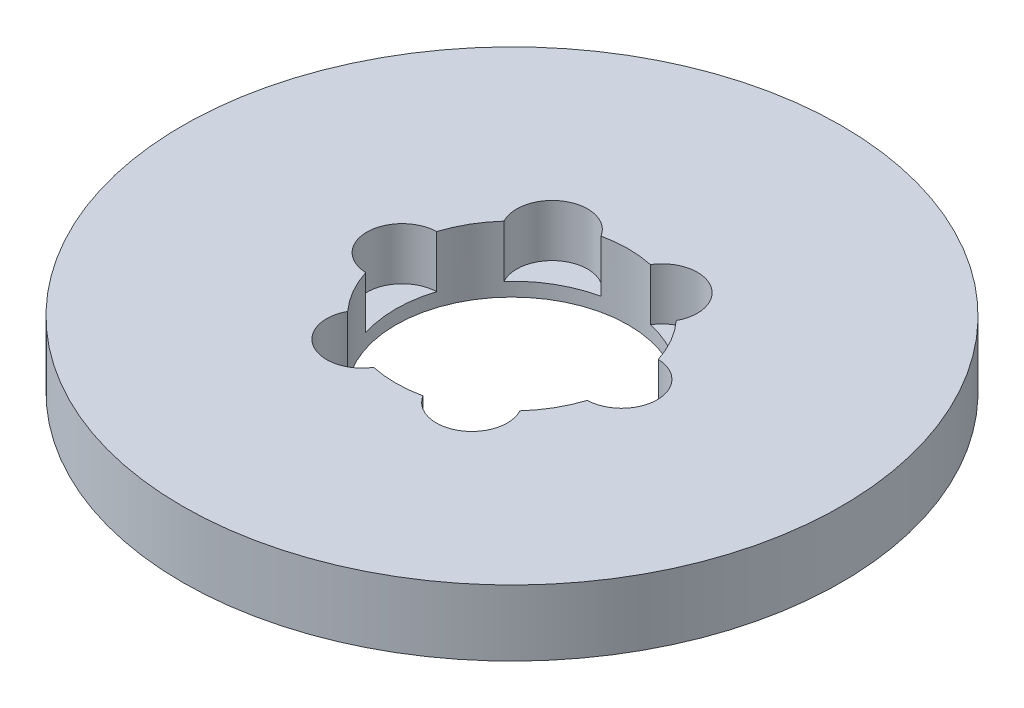
ISO-10303-21;
HEADER;
FILE_DESCRIPTION(('STEP AP214'),'2;1');
FILE_NAME('part.step','',(''),(''),'','','');
FILE_SCHEMA(('AUTOMOTIVE_DESIGN { 1 0 10303 214 1 1 1 1 }'));
ENDSEC;
DATA;
#1=APPLICATION_CONTEXT('core data for automotive mechanical design processes');
#2=APPLICATION_PROTOCOL_DEFINITION('international standard','automotive_design',2000,#1);
#3=PRODUCT_CONTEXT('',#1,'mechanical');
#4=PRODUCT('Part','Part','',(#3));
#5=PRODUCT_RELATED_PRODUCT_CATEGORY('part','',(#4));
#6=PRODUCT_DEFINITION_FORMATION('','',#4);
#7=PRODUCT_DEFINITION_CONTEXT('part definition',#1,'design');
#8=PRODUCT_DEFINITION('design','',#6,#7);
#9=PRODUCT_DEFINITION_SHAPE('','',#8);
#10=(LENGTH_UNIT() NAMED_UNIT(*) SI_UNIT(.MILLI.,.METRE.));
#11=(NAMED_UNIT(*) PLANE_ANGLE_UNIT() SI_UNIT($,.RADIAN.));
#12=(NAMED_UNIT(*) SI_UNIT($,.STERADIAN.) SOLID_ANGLE_UNIT());
#13=UNCERTAINTY_MEASURE_WITH_UNIT(LENGTH_MEASURE(1.E-05),#10,'distance_accuracy_value','');
#14=(GEOMETRIC_REPRESENTATION_CONTEXT(3) GLOBAL_UNCERTAINTY_ASSIGNED_CONTEXT((#13)) GLOBAL_UNIT_ASSIGNED_CONTEXT((#10,
#11,#12)) REPRESENTATION_CONTEXT('',''));
#15=CARTESIAN_POINT('',(0.,0.,0.));
#16=DIRECTION('',(0.,0.,1.));
#17=DIRECTION('',(1.,0.,0.));
#18=AXIS2_PLACEMENT_3D('',#15,#16,#17);
#19=CARTESIAN_POINT('',(0.,17.,0.));
#20=DIRECTION('',(0.,-1.,0.));
#21=DIRECTION('',(0.,0.,-1.));
#22=AXIS2_PLACEMENT_3D('',#19,#20,#21);
#23=CYLINDRICAL_SURFACE('',#22,85.);
#24=CARTESIAN_POINT('',(0.,17.,0.));
#25=DIRECTION('',(0.,1.,0.));
#26=DIRECTION('',(0.,0.,1.));
#27=AXIS2_PLACEMENT_3D('',#24,#25,#26);
#28=CIRCLE('',#27,85.);
#29=CARTESIAN_POINT('',(0.,17.,85.));
#30=VERTEX_POINT('',#29);
#31=EDGE_CURVE('E162',#30,#30,#28,.T.);
#32=ORIENTED_EDGE('',*,*,#31,.F.);
#33=EDGE_LOOP('',(#32));
#34=FACE_BOUND('',#33,.T.);
#35=CARTESIAN_POINT('',(0.,0.,0.));
#36=DIRECTION('',(0.,1.,0.));
#37=DIRECTION('',(0.,0.,1.));
#38=AXIS2_PLACEMENT_3D('',#35,#36,#37);
#39=CIRCLE('',#38,85.);
#40=CARTESIAN_POINT('',(0.,0.,85.));
#41=VERTEX_POINT('',#40);
#42=EDGE_CURVE('E157',#41,#41,#39,.T.);
#43=ORIENTED_EDGE('',*,*,#42,.T.);
#44=EDGE_LOOP('',(#43));
#45=FACE_BOUND('',#44,.T.);
#46=ADVANCED_FACE('F39',(#34,#45),#23,.T.);
#47=CARTESIAN_POINT('',(0.,17.,0.));
#48=DIRECTION('',(0.,1.,0.));
#49=DIRECTION('',(0.,0.,1.));
#50=AXIS2_PLACEMENT_3D('',#47,#48,#49);
#51=PLANE('',#50);
#52=CARTESIAN_POINT('',(-14.1526797020689,17.,-24.5131603072314));
#53=DIRECTION('',(0.,1.,0.));
#54=DIRECTION('',(-0.866025403784433,0.,0.50000000000001));
#55=AXIS2_PLACEMENT_3D('',#52,#53,#54);
#56=CIRCLE('',#55,9.15738785733083);
#57=CARTESIAN_POINT('',(-6.3574793077483,17.,-29.3186366813253));
#58=VERTEX_POINT('',#57);
#59=CARTESIAN_POINT('',(-22.2119445164803,17.,-20.1650569252061));
#60=VERTEX_POINT('',#59);
#61=EDGE_CURVE('E218',#58,#60,#56,.T.);
#62=ORIENTED_EDGE('',*,*,#61,.F.);
#63=CARTESIAN_POINT('',(0.,17.,0.));
#64=DIRECTION('',(0.,1.,0.));
#65=DIRECTION('',(0.,0.,1.));
#66=AXIS2_PLACEMENT_3D('',#63,#64,#65);
#67=CIRCLE('',#66,30.);
#68=CARTESIAN_POINT('',(6.35747930774768,17.,-29.3186366813254));
#69=VERTEX_POINT('',#68);
#70=EDGE_CURVE('E169',#69,#58,#67,.T.);
#71=ORIENTED_EDGE('',*,*,#70,.F.);
#72=CARTESIAN_POINT('',(14.1526797020684,17.,-24.5131603072317));
#73=DIRECTION('',(0.,1.,0.));
#74=DIRECTION('',(-0.866025403784443,0.,-0.499999999999992));
#75=AXIS2_PLACEMENT_3D('',#72,#73,#74);
#76=CIRCLE('',#75,9.15738785733083);
#77=CARTESIAN_POINT('',(22.2119445164799,17.,-20.1650569252065));
#78=VERTEX_POINT('',#77);
#79=EDGE_CURVE('E285',#78,#69,#76,.T.);
#80=ORIENTED_EDGE('',*,*,#79,.F.);
#81=CARTESIAN_POINT('',(28.569423824228,17.,-9.15357975611904));
#82=VERTEX_POINT('',#81);
#83=EDGE_CURVE('E174',#82,#78,#67,.T.);
#84=ORIENTED_EDGE('',*,*,#83,.F.);
#85=CARTESIAN_POINT('',(28.3053594041372,17.,0.));
#86=DIRECTION('',(0.,1.,0.));
#87=DIRECTION('',(0.,0.,-1.));
#88=AXIS2_PLACEMENT_3D('',#85,#86,#87);
#89=CIRCLE('',#88,9.15738785733083);
#90=CARTESIAN_POINT('',(28.569423824228,17.,9.15357975611904));
#91=VERTEX_POINT('',#90);
#92=EDGE_CURVE('E280',#91,#82,#89,.T.);
#93=ORIENTED_EDGE('',*,*,#92,.F.);
#94=CARTESIAN_POINT('',(22.2119445164802,17.,20.1650569252062));
#95=VERTEX_POINT('',#94);
#96=EDGE_CURVE('E164',#95,#91,#67,.T.);
#97=ORIENTED_EDGE('',*,*,#96,.F.);
#98=CARTESIAN_POINT('',(14.1526797020687,17.,24.5131603072315));
#99=DIRECTION('',(0.,1.,0.));
#100=DIRECTION('',(0.866025403784436,0.,-0.500000000000004));
#101=AXIS2_PLACEMENT_3D('',#98,#99,#100);
#102=CIRCLE('',#101,9.15738785733083);
#103=CARTESIAN_POINT('',(6.35747930774809,17.,29.3186366813253));
#104=VERTEX_POINT('',#103);
#105=EDGE_CURVE('E269',#104,#95,#102,.T.);
#106=ORIENTED_EDGE('',*,*,#105,.F.);
#107=CARTESIAN_POINT('',(-6.35747930774789,17.,29.3186366813254));
#108=VERTEX_POINT('',#107);
#109=EDGE_CURVE('E149',#108,#104,#67,.T.);
#110=ORIENTED_EDGE('',*,*,#109,.F.);
#111=CARTESIAN_POINT('',(-14.1526797020686,17.,24.5131603072316));
#112=DIRECTION('',(0.,1.,0.));
#113=DIRECTION('',(0.86602540378444,0.,0.499999999999998));
#114=AXIS2_PLACEMENT_3D('',#111,#112,#113);
#115=CIRCLE('',#114,9.15738785733083);
#116=CARTESIAN_POINT('',(-22.21194451648,17.,20.1650569252064));
#117=VERTEX_POINT('',#116);
#118=EDGE_CURVE('E128',#117,#108,#115,.T.);
#119=ORIENTED_EDGE('',*,*,#118,.F.);
#120=CARTESIAN_POINT('',(-28.569423824228,17.,9.15357975611904));
#121=VERTEX_POINT('',#120);
#122=EDGE_CURVE('E148',#121,#117,#67,.T.);
#123=ORIENTED_EDGE('',*,*,#122,.F.);
#124=CARTESIAN_POINT('',(-28.3053594041372,17.,0.));
#125=DIRECTION('',(0.,1.,0.));
#126=DIRECTION('',(0.,0.,1.));
#127=AXIS2_PLACEMENT_3D('',#124,#125,#126);
#128=CIRCLE('',#127,9.15738785733083);
#129=CARTESIAN_POINT('',(-28.569423824228,17.,-9.15357975611904));
#130=VERTEX_POINT('',#129);
#131=EDGE_CURVE('E179',#130,#121,#128,.T.);
#132=ORIENTED_EDGE('',*,*,#131,.F.);
#133=EDGE_CURVE('E161',#60,#130,#67,.T.);
#134=ORIENTED_EDGE('',*,*,#133,.F.);
#135=EDGE_LOOP('',(#62,#71,#80,#84,#93,#97,#106,#110,#119,#123,#132,#134));
#136=FACE_BOUND('',#135,.T.);
#137=ORIENTED_EDGE('',*,*,#31,.T.);
#138=EDGE_LOOP('',(#137));
#139=FACE_BOUND('',#138,.T.);
#140=ADVANCED_FACE('F141',(#136,#139),#51,.T.);
#141=CARTESIAN_POINT('',(0.,0.,0.));
#142=DIRECTION('',(0.,1.,0.));
#143=DIRECTION('',(0.,0.,1.));
#144=AXIS2_PLACEMENT_3D('',#141,#142,#143);
#145=PLANE('',#144);
#146=CARTESIAN_POINT('',(0.,0.,0.));
#147=DIRECTION('',(0.,1.,0.));
#148=DIRECTION('',(0.,0.,1.));
#149=AXIS2_PLACEMENT_3D('',#146,#147,#148);
#150=CIRCLE('',#149,30.);
#151=CARTESIAN_POINT('',(0.,0.,30.));
#152=VERTEX_POINT('',#151);
#153=EDGE_CURVE('E166',#152,#152,#150,.T.);
#154=ORIENTED_EDGE('',*,*,#153,.T.);
#155=EDGE_LOOP('',(#154));
#156=FACE_BOUND('',#155,.T.);
#157=ORIENTED_EDGE('',*,*,#42,.F.);
#158=EDGE_LOOP('',(#157));
#159=FACE_BOUND('',#158,.T.);
#160=ADVANCED_FACE('F234',(#156,#159),#145,.F.);
#161=CARTESIAN_POINT('',(0.,17.,0.));
#162=DIRECTION('',(0.,-1.,0.));
#163=DIRECTION('',(0.,0.,-1.));
#164=AXIS2_PLACEMENT_3D('',#161,#162,#163);
#165=CYLINDRICAL_SURFACE('',#164,30.);
#166=DIRECTION('',(0.,1.,0.));
#167=VECTOR('',#166,1.);
#168=CARTESIAN_POINT('',(-6.3574793077483,10.2793345800739,-29.3186366813253));
#169=LINE('',#168,#167);
#170=CARTESIAN_POINT('',(-6.3574793077483,3.55866916014774,-29.3186366813253));
#171=VERTEX_POINT('',#170);
#172=EDGE_CURVE('E11',#171,#58,#169,.T.);
#173=ORIENTED_EDGE('',*,*,#172,.F.);
#174=CARTESIAN_POINT('',(0.,3.55866916014774,0.));
#175=DIRECTION('',(0.,1.,0.));
#176=DIRECTION('',(0.,0.,1.));
#177=AXIS2_PLACEMENT_3D('',#174,#175,#176);
#178=CIRCLE('',#177,30.);
#179=CARTESIAN_POINT('',(-22.2119445164803,3.55866916014774,-20.1650569252061));
#180=VERTEX_POINT('',#179);
#181=EDGE_CURVE('E214',#171,#180,#178,.T.);
#182=ORIENTED_EDGE('',*,*,#181,.T.);
#183=DIRECTION('',(0.,1.,0.));
#184=VECTOR('',#183,1.);
#185=CARTESIAN_POINT('',(-22.2119445164803,10.2793345800739,-20.1650569252061));
#186=LINE('',#185,#184);
#187=EDGE_CURVE('E46',#60,#180,#186,.F.);
#188=ORIENTED_EDGE('',*,*,#187,.F.);
#189=ORIENTED_EDGE('',*,*,#133,.T.);
#190=DIRECTION('',(0.,1.,0.));
#191=VECTOR('',#190,1.);
#192=CARTESIAN_POINT('',(-28.569423824228,10.2793345800739,-9.15357975611904));
#193=LINE('',#192,#191);
#194=CARTESIAN_POINT('',(-28.569423824228,3.55866916014774,-9.15357975611904));
#195=VERTEX_POINT('',#194);
#196=EDGE_CURVE('E187',#195,#130,#193,.T.);
#197=ORIENTED_EDGE('',*,*,#196,.F.);
#198=CARTESIAN_POINT('',(0.,3.55866916014774,0.));
#199=DIRECTION('',(0.,1.,0.));
#200=DIRECTION('',(0.,0.,1.));
#201=AXIS2_PLACEMENT_3D('',#198,#199,#200);
#202=CIRCLE('',#201,30.);
#203=CARTESIAN_POINT('',(-28.569423824228,3.55866916014774,9.15357975611904));
#204=VERTEX_POINT('',#203);
#205=EDGE_CURVE('E184',#195,#204,#202,.T.);
#206=ORIENTED_EDGE('',*,*,#205,.T.);
#207=DIRECTION('',(0.,1.,0.));
#208=VECTOR('',#207,1.);
#209=CARTESIAN_POINT('',(-28.569423824228,10.2793345800739,9.15357975611904));
#210=LINE('',#209,#208);
#211=EDGE_CURVE('E158',#121,#204,#210,.F.);
#212=ORIENTED_EDGE('',*,*,#211,.F.);
#213=ORIENTED_EDGE('',*,*,#122,.T.);
#214=DIRECTION('',(0.,1.,0.));
#215=VECTOR('',#214,1.);
#216=CARTESIAN_POINT('',(-22.21194451648,10.2793345800739,20.1650569252064));
#217=LINE('',#216,#215);
#218=CARTESIAN_POINT('',(-22.21194451648,3.55866916014774,20.1650569252064));
#219=VERTEX_POINT('',#218);
#220=EDGE_CURVE('E127',#219,#117,#217,.T.);
#221=ORIENTED_EDGE('',*,*,#220,.F.);
#222=CARTESIAN_POINT('',(0.,3.55866916014774,0.));
#223=DIRECTION('',(0.,1.,0.));
#224=DIRECTION('',(0.,0.,1.));
#225=AXIS2_PLACEMENT_3D('',#222,#223,#224);
#226=CIRCLE('',#225,30.);
#227=CARTESIAN_POINT('',(-6.35747930774789,3.55866916014774,29.3186366813254));
#228=VERTEX_POINT('',#227);
#229=EDGE_CURVE('E189',#219,#228,#226,.T.);
#230=ORIENTED_EDGE('',*,*,#229,.T.);
#231=DIRECTION('',(0.,1.,0.));
#232=VECTOR('',#231,1.);
#233=CARTESIAN_POINT('',(-6.35747930774788,10.2793345800739,29.3186366813254));
#234=LINE('',#233,#232);
#235=EDGE_CURVE('E140',#108,#228,#234,.F.);
#236=ORIENTED_EDGE('',*,*,#235,.F.);
#237=ORIENTED_EDGE('',*,*,#109,.T.);
#238=DIRECTION('',(0.,1.,0.));
#239=VECTOR('',#238,1.);
#240=CARTESIAN_POINT('',(6.35747930774809,10.2793345800739,29.3186366813253));
#241=LINE('',#240,#239);
#242=CARTESIAN_POINT('',(6.35747930774809,3.55866916014774,29.3186366813253));
#243=VERTEX_POINT('',#242);
#244=EDGE_CURVE('E196',#243,#104,#241,.T.);
#245=ORIENTED_EDGE('',*,*,#244,.F.);
#246=CARTESIAN_POINT('',(0.,3.55866916014774,0.));
#247=DIRECTION('',(0.,1.,0.));
#248=DIRECTION('',(0.,0.,1.));
#249=AXIS2_PLACEMENT_3D('',#246,#247,#248);
#250=CIRCLE('',#249,30.);
#251=CARTESIAN_POINT('',(22.2119445164802,3.55866916014774,20.1650569252062));
#252=VERTEX_POINT('',#251);
#253=EDGE_CURVE('E136',#243,#252,#250,.T.);
#254=ORIENTED_EDGE('',*,*,#253,.T.);
#255=DIRECTION('',(0.,1.,0.));
#256=VECTOR('',#255,1.);
#257=CARTESIAN_POINT('',(22.2119445164802,10.2793345800739,20.1650569252062));
#258=LINE('',#257,#256);
#259=EDGE_CURVE('E194',#95,#252,#258,.F.);
#260=ORIENTED_EDGE('',*,*,#259,.F.);
#261=ORIENTED_EDGE('',*,*,#96,.T.);
#262=DIRECTION('',(0.,1.,0.));
#263=VECTOR('',#262,1.);
#264=CARTESIAN_POINT('',(28.569423824228,10.2793345800739,9.15357975611904));
#265=LINE('',#264,#263);
#266=CARTESIAN_POINT('',(28.569423824228,3.55866916014774,9.15357975611904));
#267=VERTEX_POINT('',#266);
#268=EDGE_CURVE('E206',#267,#91,#265,.T.);
#269=ORIENTED_EDGE('',*,*,#268,.F.);
#270=CARTESIAN_POINT('',(0.,3.55866916014774,0.));
#271=DIRECTION('',(0.,1.,0.));
#272=DIRECTION('',(0.,0.,1.));
#273=AXIS2_PLACEMENT_3D('',#270,#271,#272);
#274=CIRCLE('',#273,30.);
#275=CARTESIAN_POINT('',(28.569423824228,3.55866916014774,-9.15357975611904));
#276=VERTEX_POINT('',#275);
#277=EDGE_CURVE('E199',#267,#276,#274,.T.);
#278=ORIENTED_EDGE('',*,*,#277,.T.);
#279=DIRECTION('',(0.,1.,0.));
#280=VECTOR('',#279,1.);
#281=CARTESIAN_POINT('',(28.569423824228,10.2793345800739,-9.15357975611904));
#282=LINE('',#281,#280);
#283=EDGE_CURVE('E201',#82,#276,#282,.F.);
#284=ORIENTED_EDGE('',*,*,#283,.F.);
#285=ORIENTED_EDGE('',*,*,#83,.T.);
#286=DIRECTION('',(0.,1.,0.));
#287=VECTOR('',#286,1.);
#288=CARTESIAN_POINT('',(22.2119445164799,10.2793345800739,-20.1650569252065));
#289=LINE('',#288,#287);
#290=CARTESIAN_POINT('',(22.2119445164799,3.55866916014774,-20.1650569252065));
#291=VERTEX_POINT('',#290);
#292=EDGE_CURVE('E213',#291,#78,#289,.T.);
#293=ORIENTED_EDGE('',*,*,#292,.F.);
#294=CARTESIAN_POINT('',(0.,3.55866916014774,0.));
#295=DIRECTION('',(0.,1.,0.));
#296=DIRECTION('',(0.,0.,1.));
#297=AXIS2_PLACEMENT_3D('',#294,#295,#296);
#298=CIRCLE('',#297,30.);
#299=CARTESIAN_POINT('',(6.35747930774768,3.55866916014774,-29.3186366813254));
#300=VERTEX_POINT('',#299);
#301=EDGE_CURVE('E208',#291,#300,#298,.T.);
#302=ORIENTED_EDGE('',*,*,#301,.T.);
#303=DIRECTION('',(0.,1.,0.));
#304=VECTOR('',#303,1.);
#305=CARTESIAN_POINT('',(6.35747930774768,10.2793345800739,-29.3186366813254));
#306=LINE('',#305,#304);
#307=EDGE_CURVE('E211',#69,#300,#306,.F.);
#308=ORIENTED_EDGE('',*,*,#307,.F.);
#309=ORIENTED_EDGE('',*,*,#70,.T.);
#310=EDGE_LOOP('',(#173,#182,#188,#189,#197,#206,#212,#213,#221,#230,#236,#237,#245,#254,#260,
#261,#269,#278,#284,#285,#293,#302,#308,#309));
#311=FACE_BOUND('',#310,.T.);
#312=ORIENTED_EDGE('',*,*,#153,.F.);
#313=EDGE_LOOP('',(#312));
#314=FACE_BOUND('',#313,.T.);
#315=ADVANCED_FACE('F152',(#311,#314),#165,.F.);
#316=CARTESIAN_POINT('',(-28.3053594041372,3.55866916014774,0.));
#317=DIRECTION('',(0.,1.,0.));
#318=DIRECTION('',(0.,0.,1.));
#319=AXIS2_PLACEMENT_3D('',#316,#317,#318);
#320=CYLINDRICAL_SURFACE('',#319,9.15738785733083);
#321=ORIENTED_EDGE('',*,*,#196,.T.);
#322=ORIENTED_EDGE('',*,*,#131,.T.);
#323=ORIENTED_EDGE('',*,*,#211,.T.);
#324=CARTESIAN_POINT('',(-28.3053594041372,3.55866916014774,0.));
#325=DIRECTION('',(0.,1.,0.));
#326=DIRECTION('',(0.,0.,1.));
#327=AXIS2_PLACEMENT_3D('',#324,#325,#326);
#328=CIRCLE('',#327,9.15738785733083);
#329=EDGE_CURVE('E180',#195,#204,#328,.T.);
#330=ORIENTED_EDGE('',*,*,#329,.F.);
#331=EDGE_LOOP('',(#321,#322,#323,#330));
#332=FACE_BOUND('',#331,.T.);
#333=ADVANCED_FACE('F244',(#332),#320,.F.);
#334=CARTESIAN_POINT('',(-28.3053594041372,3.55866916014774,0.));
#335=DIRECTION('',(0.,1.,0.));
#336=DIRECTION('',(0.,0.,1.));
#337=AXIS2_PLACEMENT_3D('',#334,#335,#336);
#338=PLANE('',#337);
#339=ORIENTED_EDGE('',*,*,#329,.T.);
#340=ORIENTED_EDGE('',*,*,#205,.F.);
#341=EDGE_LOOP('',(#339,#340));
#342=FACE_BOUND('',#341,.T.);
#343=ADVANCED_FACE('F248',(#342),#338,.T.);
#344=CARTESIAN_POINT('',(-14.1526797020686,3.55866916014774,24.5131603072316));
#345=DIRECTION('',(0.,1.,0.));
#346=DIRECTION('',(0.,0.,1.));
#347=AXIS2_PLACEMENT_3D('',#344,#345,#346);
#348=CYLINDRICAL_SURFACE('',#347,9.15738785733083);
#349=ORIENTED_EDGE('',*,*,#220,.T.);
#350=ORIENTED_EDGE('',*,*,#118,.T.);
#351=ORIENTED_EDGE('',*,*,#235,.T.);
#352=CARTESIAN_POINT('',(-14.1526797020686,3.55866916014774,24.5131603072316));
#353=DIRECTION('',(0.,1.,0.));
#354=DIRECTION('',(0.86602540378444,0.,0.499999999999998));
#355=AXIS2_PLACEMENT_3D('',#352,#353,#354);
#356=CIRCLE('',#355,9.15738785733083);
#357=EDGE_CURVE('E135',#219,#228,#356,.T.);
#358=ORIENTED_EDGE('',*,*,#357,.F.);
#359=EDGE_LOOP('',(#349,#350,#351,#358));
#360=FACE_BOUND('',#359,.T.);
#361=ADVANCED_FACE('F126',(#360),#348,.F.);
#362=CARTESIAN_POINT('',(-14.1526797020686,3.55866916014774,24.5131603072316));
#363=DIRECTION('',(0.,1.,0.));
#364=DIRECTION('',(0.86602540378444,0.,0.499999999999998));
#365=AXIS2_PLACEMENT_3D('',#362,#363,#364);
#366=PLANE('',#365);
#367=ORIENTED_EDGE('',*,*,#357,.T.);
#368=ORIENTED_EDGE('',*,*,#229,.F.);
#369=EDGE_LOOP('',(#367,#368));
#370=FACE_BOUND('',#369,.T.);
#371=ADVANCED_FACE('F258',(#370),#366,.T.);
#372=CARTESIAN_POINT('',(14.1526797020687,3.55866916014774,24.5131603072315));
#373=DIRECTION('',(0.,1.,0.));
#374=DIRECTION('',(0.,0.,1.));
#375=AXIS2_PLACEMENT_3D('',#372,#373,#374);
#376=CYLINDRICAL_SURFACE('',#375,9.15738785733083);
#377=ORIENTED_EDGE('',*,*,#244,.T.);
#378=ORIENTED_EDGE('',*,*,#105,.T.);
#379=ORIENTED_EDGE('',*,*,#259,.T.);
#380=CARTESIAN_POINT('',(14.1526797020687,3.55866916014774,24.5131603072315));
#381=DIRECTION('',(0.,1.,0.));
#382=DIRECTION('',(0.866025403784436,0.,-0.500000000000004));
#383=AXIS2_PLACEMENT_3D('',#380,#381,#382);
#384=CIRCLE('',#383,9.15738785733083);
#385=EDGE_CURVE('E147',#243,#252,#384,.T.);
#386=ORIENTED_EDGE('',*,*,#385,.F.);
#387=EDGE_LOOP('',(#377,#378,#379,#386));
#388=FACE_BOUND('',#387,.T.);
#389=ADVANCED_FACE('F256',(#388),#376,.F.);
#390=CARTESIAN_POINT('',(14.1526797020687,3.55866916014774,24.5131603072315));
#391=DIRECTION('',(0.,1.,0.));
#392=DIRECTION('',(0.866025403784436,0.,-0.500000000000004));
#393=AXIS2_PLACEMENT_3D('',#390,#391,#392);
#394=PLANE('',#393);
#395=ORIENTED_EDGE('',*,*,#385,.T.);
#396=ORIENTED_EDGE('',*,*,#253,.F.);
#397=EDGE_LOOP('',(#395,#396));
#398=FACE_BOUND('',#397,.T.);
#399=ADVANCED_FACE('F263',(#398),#394,.T.);
#400=CARTESIAN_POINT('',(28.3053594041372,3.55866916014774,0.));
#401=DIRECTION('',(0.,1.,0.));
#402=DIRECTION('',(0.,0.,1.));
#403=AXIS2_PLACEMENT_3D('',#400,#401,#402);
#404=CYLINDRICAL_SURFACE('',#403,9.15738785733083);
#405=ORIENTED_EDGE('',*,*,#268,.T.);
#406=ORIENTED_EDGE('',*,*,#92,.T.);
#407=ORIENTED_EDGE('',*,*,#283,.T.);
#408=CARTESIAN_POINT('',(28.3053594041372,3.55866916014774,0.));
#409=DIRECTION('',(0.,1.,0.));
#410=DIRECTION('',(0.,0.,-1.));
#411=AXIS2_PLACEMENT_3D('',#408,#409,#410);
#412=CIRCLE('',#411,9.15738785733083);
#413=EDGE_CURVE('E273',#267,#276,#412,.T.);
#414=ORIENTED_EDGE('',*,*,#413,.F.);
#415=EDGE_LOOP('',(#405,#406,#407,#414));
#416=FACE_BOUND('',#415,.T.);
#417=ADVANCED_FACE('F297',(#416),#404,.F.);
#418=CARTESIAN_POINT('',(28.3053594041372,3.55866916014774,0.));
#419=DIRECTION('',(0.,1.,0.));
#420=DIRECTION('',(0.,0.,-1.));
#421=AXIS2_PLACEMENT_3D('',#418,#419,#420);
#422=PLANE('',#421);
#423=ORIENTED_EDGE('',*,*,#413,.T.);
#424=ORIENTED_EDGE('',*,*,#277,.F.);
#425=EDGE_LOOP('',(#423,#424));
#426=FACE_BOUND('',#425,.T.);
#427=ADVANCED_FACE('F299',(#426),#422,.T.);
#428=CARTESIAN_POINT('',(14.1526797020684,3.55866916014774,-24.5131603072317));
#429=DIRECTION('',(0.,1.,0.));
#430=DIRECTION('',(0.,0.,1.));
#431=AXIS2_PLACEMENT_3D('',#428,#429,#430);
#432=CYLINDRICAL_SURFACE('',#431,9.15738785733083);
#433=ORIENTED_EDGE('',*,*,#292,.T.);
#434=ORIENTED_EDGE('',*,*,#79,.T.);
#435=ORIENTED_EDGE('',*,*,#307,.T.);
#436=CARTESIAN_POINT('',(14.1526797020684,3.55866916014774,-24.5131603072317));
#437=DIRECTION('',(0.,1.,0.));
#438=DIRECTION('',(-0.866025403784443,0.,-0.499999999999992));
#439=AXIS2_PLACEMENT_3D('',#436,#437,#438);
#440=CIRCLE('',#439,9.15738785733083);
#441=EDGE_CURVE('E56',#291,#300,#440,.T.);
#442=ORIENTED_EDGE('',*,*,#441,.F.);
#443=EDGE_LOOP('',(#433,#434,#435,#442));
#444=FACE_BOUND('',#443,.T.);
#445=ADVANCED_FACE('F292',(#444),#432,.F.);
#446=CARTESIAN_POINT('',(14.1526797020684,3.55866916014774,-24.5131603072317));
#447=DIRECTION('',(0.,1.,0.));
#448=DIRECTION('',(-0.866025403784443,0.,-0.499999999999992));
#449=AXIS2_PLACEMENT_3D('',#446,#447,#448);
#450=PLANE('',#449);
#451=ORIENTED_EDGE('',*,*,#441,.T.);
#452=ORIENTED_EDGE('',*,*,#301,.F.);
#453=EDGE_LOOP('',(#451,#452));
#454=FACE_BOUND('',#453,.T.);
#455=ADVANCED_FACE('F226',(#454),#450,.T.);
#456=CARTESIAN_POINT('',(-14.1526797020689,3.55866916014774,-24.5131603072314));
#457=DIRECTION('',(0.,1.,0.));
#458=DIRECTION('',(0.,0.,1.));
#459=AXIS2_PLACEMENT_3D('',#456,#457,#458);
#460=CYLINDRICAL_SURFACE('',#459,9.15738785733083);
#461=ORIENTED_EDGE('',*,*,#172,.T.);
#462=ORIENTED_EDGE('',*,*,#61,.T.);
#463=ORIENTED_EDGE('',*,*,#187,.T.);
#464=CARTESIAN_POINT('',(-14.1526797020689,3.55866916014774,-24.5131603072314));
#465=DIRECTION('',(0.,1.,0.));
#466=DIRECTION('',(-0.866025403784433,0.,0.50000000000001));
#467=AXIS2_PLACEMENT_3D('',#464,#465,#466);
#468=CIRCLE('',#467,9.15738785733083);
#469=EDGE_CURVE('E55',#171,#180,#468,.T.);
#470=ORIENTED_EDGE('',*,*,#469,.F.);
#471=EDGE_LOOP('',(#461,#462,#463,#470));
#472=FACE_BOUND('',#471,.T.);
#473=ADVANCED_FACE('F217',(#472),#460,.F.);
#474=CARTESIAN_POINT('',(-14.1526797020689,3.55866916014774,-24.5131603072314));
#475=DIRECTION('',(0.,1.,0.));
#476=DIRECTION('',(-0.866025403784433,0.,0.50000000000001));
#477=AXIS2_PLACEMENT_3D('',#474,#475,#476);
#478=PLANE('',#477);
#479=ORIENTED_EDGE('',*,*,#469,.T.);
#480=ORIENTED_EDGE('',*,*,#181,.F.);
#481=EDGE_LOOP('',(#479,#480));
#482=FACE_BOUND('',#481,.T.);
#483=ADVANCED_FACE('F219',(#482),#478,.T.);
#484=CLOSED_SHELL('',(#46,#140,#160,#315,#333,#343,#361,#371,#389,#399,#417,#427,#445,#455,#473,#483));
#485=MANIFOLD_SOLID_BREP('B2',#484);
#486=ADVANCED_BREP_SHAPE_REPRESENTATION('',(#18,#485),#14);
#487=SHAPE_DEFINITION_REPRESENTATION(#9,#486);
ENDSEC;
END-ISO-10303-21;
